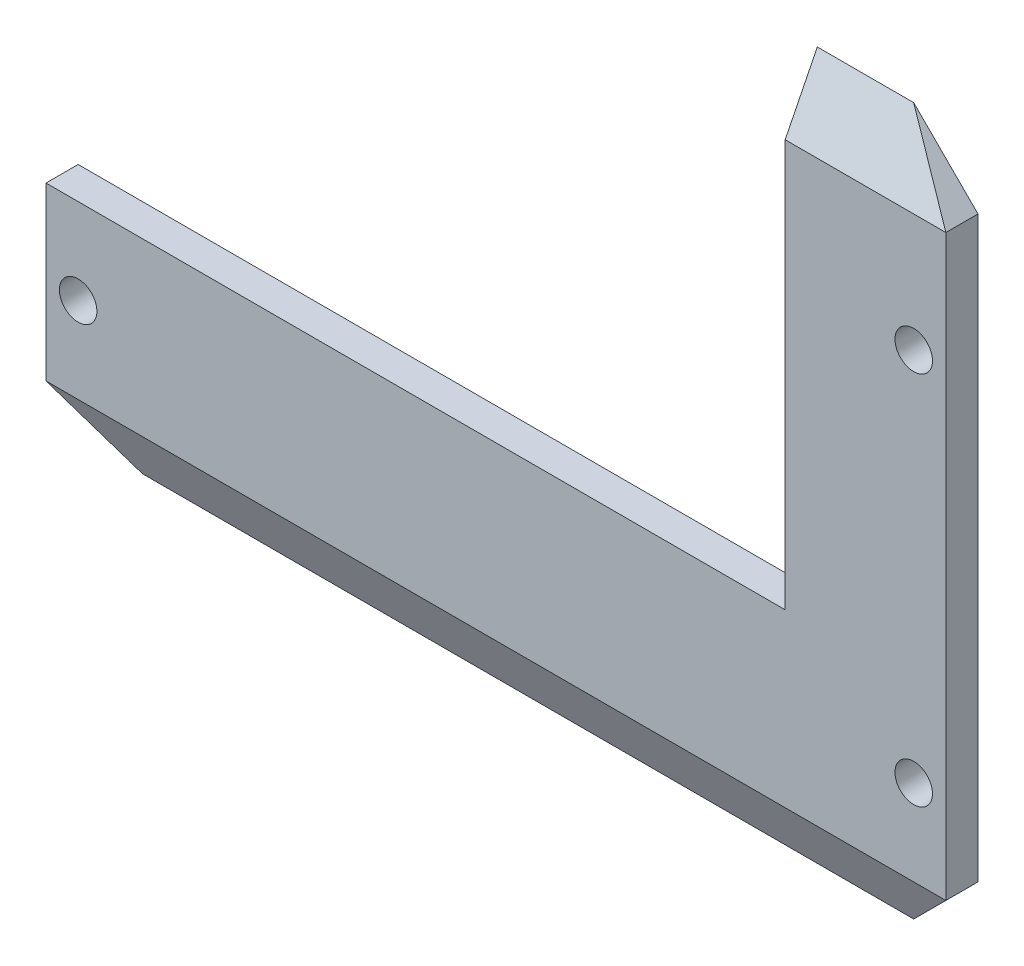
ISO-10303-21;
HEADER;
FILE_DESCRIPTION(('STEP AP214'),'2;1');
FILE_NAME('part.step','',(''),(''),'','','');
FILE_SCHEMA(('AUTOMOTIVE_DESIGN { 1 0 10303 214 1 1 1 1 }'));
ENDSEC;
DATA;
#1=APPLICATION_CONTEXT('core data for automotive mechanical design processes');
#2=APPLICATION_PROTOCOL_DEFINITION('international standard','automotive_design',2000,#1);
#3=PRODUCT_CONTEXT('',#1,'mechanical');
#4=PRODUCT('Part','Part','',(#3));
#5=PRODUCT_RELATED_PRODUCT_CATEGORY('part','',(#4));
#6=PRODUCT_DEFINITION_FORMATION('','',#4);
#7=PRODUCT_DEFINITION_CONTEXT('part definition',#1,'design');
#8=PRODUCT_DEFINITION('design','',#6,#7);
#9=PRODUCT_DEFINITION_SHAPE('','',#8);
#10=(LENGTH_UNIT() NAMED_UNIT(*) SI_UNIT(.MILLI.,.METRE.));
#11=(NAMED_UNIT(*) PLANE_ANGLE_UNIT() SI_UNIT($,.RADIAN.));
#12=(NAMED_UNIT(*) SI_UNIT($,.STERADIAN.) SOLID_ANGLE_UNIT());
#13=UNCERTAINTY_MEASURE_WITH_UNIT(LENGTH_MEASURE(1.E-05),#10,'distance_accuracy_value','');
#14=(GEOMETRIC_REPRESENTATION_CONTEXT(3) GLOBAL_UNCERTAINTY_ASSIGNED_CONTEXT((#13)) GLOBAL_UNIT_ASSIGNED_CONTEXT((#10,
#11,#12)) REPRESENTATION_CONTEXT('',''));
#15=CARTESIAN_POINT('',(0.,0.,0.));
#16=DIRECTION('',(0.,0.,1.));
#17=DIRECTION('',(1.,0.,0.));
#18=AXIS2_PLACEMENT_3D('',#15,#16,#17);
#19=CARTESIAN_POINT('',(42.,-33.,3.));
#20=DIRECTION('',(-1.,0.,0.));
#21=DIRECTION('',(0.,0.,1.));
#22=AXIS2_PLACEMENT_3D('',#19,#20,#21);
#23=PLANE('',#22);
#24=DIRECTION('',(0.,1.,0.));
#25=VECTOR('',#24,1.);
#26=CARTESIAN_POINT('',(42.,-33.,0.));
#27=LINE('',#26,#25);
#28=CARTESIAN_POINT('',(42.,-27.,0.));
#29=VERTEX_POINT('',#28);
#30=CARTESIAN_POINT('',(42.,27.,0.));
#31=VERTEX_POINT('',#30);
#32=EDGE_CURVE('E126',#29,#31,#27,.T.);
#33=ORIENTED_EDGE('',*,*,#32,.T.);
#34=DIRECTION('',(0.,0.,1.));
#35=VECTOR('',#34,1.);
#36=CARTESIAN_POINT('',(42.,27.,3.));
#37=LINE('',#36,#35);
#38=CARTESIAN_POINT('',(42.,27.,3.));
#39=VERTEX_POINT('',#38);
#40=EDGE_CURVE('E147',#31,#39,#37,.T.);
#41=ORIENTED_EDGE('',*,*,#40,.T.);
#42=DIRECTION('',(0.,1.,0.));
#43=VECTOR('',#42,1.);
#44=CARTESIAN_POINT('',(42.,-33.,3.));
#45=LINE('',#44,#43);
#46=CARTESIAN_POINT('',(42.,-27.,3.));
#47=VERTEX_POINT('',#46);
#48=EDGE_CURVE('E117',#47,#39,#45,.T.);
#49=ORIENTED_EDGE('',*,*,#48,.F.);
#50=DIRECTION('',(0.,0.,-1.));
#51=VECTOR('',#50,1.);
#52=CARTESIAN_POINT('',(42.,-27.,3.));
#53=LINE('',#52,#51);
#54=EDGE_CURVE('E144',#47,#29,#53,.T.);
#55=ORIENTED_EDGE('',*,*,#54,.T.);
#56=EDGE_LOOP('',(#33,#41,#49,#55));
#57=FACE_BOUND('',#56,.T.);
#58=ADVANCED_FACE('F32',(#57),#23,.F.);
#59=CARTESIAN_POINT('',(-42.,-33.,3.));
#60=DIRECTION('',(1.,0.,0.));
#61=DIRECTION('',(0.,0.,-1.));
#62=AXIS2_PLACEMENT_3D('',#59,#60,#61);
#63=PLANE('',#62);
#64=DIRECTION('',(0.,-1.,0.));
#65=VECTOR('',#64,1.);
#66=CARTESIAN_POINT('',(-42.,-33.,3.));
#67=LINE('',#66,#65);
#68=CARTESIAN_POINT('',(-42.,-11.,3.));
#69=VERTEX_POINT('',#68);
#70=CARTESIAN_POINT('',(-42.,-27.,3.));
#71=VERTEX_POINT('',#70);
#72=EDGE_CURVE('E109',#69,#71,#67,.T.);
#73=ORIENTED_EDGE('',*,*,#72,.F.);
#74=DIRECTION('',(0.,0.,1.));
#75=VECTOR('',#74,1.);
#76=CARTESIAN_POINT('',(-42.,-11.,-7.));
#77=LINE('',#76,#75);
#78=CARTESIAN_POINT('',(-42.,-11.,0.));
#79=VERTEX_POINT('',#78);
#80=EDGE_CURVE('E94',#79,#69,#77,.T.);
#81=ORIENTED_EDGE('',*,*,#80,.F.);
#82=DIRECTION('',(0.,-1.,0.));
#83=VECTOR('',#82,1.);
#84=CARTESIAN_POINT('',(-42.,-33.,0.));
#85=LINE('',#84,#83);
#86=CARTESIAN_POINT('',(-42.,-27.,0.));
#87=VERTEX_POINT('',#86);
#88=EDGE_CURVE('E133',#79,#87,#85,.T.);
#89=ORIENTED_EDGE('',*,*,#88,.T.);
#90=DIRECTION('',(0.,0.,1.));
#91=VECTOR('',#90,1.);
#92=CARTESIAN_POINT('',(-42.,-27.,3.));
#93=LINE('',#92,#91);
#94=EDGE_CURVE('E115',#87,#71,#93,.T.);
#95=ORIENTED_EDGE('',*,*,#94,.T.);
#96=EDGE_LOOP('',(#73,#81,#89,#95));
#97=FACE_BOUND('',#96,.T.);
#98=ADVANCED_FACE('F113',(#97),#63,.F.);
#99=CARTESIAN_POINT('',(0.,0.,3.));
#100=DIRECTION('',(0.,0.,-1.));
#101=DIRECTION('',(-1.,0.,0.));
#102=AXIS2_PLACEMENT_3D('',#99,#100,#101);
#103=PLANE('',#102);
#104=CARTESIAN_POINT('',(39.,-19.,3.));
#105=DIRECTION('',(0.,0.,1.));
#106=DIRECTION('',(-1.,0.,0.));
#107=AXIS2_PLACEMENT_3D('',#104,#105,#106);
#108=CIRCLE('',#107,1.75);
#109=CARTESIAN_POINT('',(37.25,-19.,3.));
#110=VERTEX_POINT('',#109);
#111=EDGE_CURVE('E304',#110,#110,#108,.T.);
#112=ORIENTED_EDGE('',*,*,#111,.F.);
#113=EDGE_LOOP('',(#112));
#114=FACE_BOUND('',#113,.T.);
#115=CARTESIAN_POINT('',(39.,16.,3.));
#116=DIRECTION('',(0.,0.,1.));
#117=DIRECTION('',(1.,0.,0.));
#118=AXIS2_PLACEMENT_3D('',#115,#116,#117);
#119=CIRCLE('',#118,1.75);
#120=CARTESIAN_POINT('',(40.75,16.,3.));
#121=VERTEX_POINT('',#120);
#122=EDGE_CURVE('E166',#121,#121,#119,.T.);
#123=ORIENTED_EDGE('',*,*,#122,.F.);
#124=EDGE_LOOP('',(#123));
#125=FACE_BOUND('',#124,.T.);
#126=CARTESIAN_POINT('',(-39.,-19.,3.));
#127=DIRECTION('',(0.,0.,1.));
#128=DIRECTION('',(1.,0.,0.));
#129=AXIS2_PLACEMENT_3D('',#126,#127,#128);
#130=CIRCLE('',#129,1.75);
#131=CARTESIAN_POINT('',(-37.25,-19.,3.));
#132=VERTEX_POINT('',#131);
#133=EDGE_CURVE('E307',#132,#132,#130,.T.);
#134=ORIENTED_EDGE('',*,*,#133,.F.);
#135=EDGE_LOOP('',(#134));
#136=FACE_BOUND('',#135,.T.);
#137=DIRECTION('',(-1.,0.,0.));
#138=VECTOR('',#137,1.);
#139=CARTESIAN_POINT('',(0.,26.9999999999999,3.));
#140=LINE('',#139,#138);
#141=CARTESIAN_POINT('',(27.,26.9999999999999,3.));
#142=VERTEX_POINT('',#141);
#143=EDGE_CURVE('E151',#39,#142,#140,.T.);
#144=ORIENTED_EDGE('',*,*,#143,.T.);
#145=DIRECTION('',(0.,1.,0.));
#146=VECTOR('',#145,1.);
#147=CARTESIAN_POINT('',(27.,-11.,3.));
#148=LINE('',#147,#146);
#149=CARTESIAN_POINT('',(27.,-11.,3.));
#150=VERTEX_POINT('',#149);
#151=EDGE_CURVE('E47',#150,#142,#148,.T.);
#152=ORIENTED_EDGE('',*,*,#151,.F.);
#153=DIRECTION('',(1.,0.,0.));
#154=VECTOR('',#153,1.);
#155=CARTESIAN_POINT('',(27.,-11.,3.));
#156=LINE('',#155,#154);
#157=EDGE_CURVE('E98',#69,#150,#156,.T.);
#158=ORIENTED_EDGE('',*,*,#157,.F.);
#159=ORIENTED_EDGE('',*,*,#72,.T.);
#160=DIRECTION('',(1.,0.,0.));
#161=VECTOR('',#160,1.);
#162=CARTESIAN_POINT('',(0.,-27.,3.));
#163=LINE('',#162,#161);
#164=EDGE_CURVE('E149',#71,#47,#163,.T.);
#165=ORIENTED_EDGE('',*,*,#164,.T.);
#166=ORIENTED_EDGE('',*,*,#48,.T.);
#167=EDGE_LOOP('',(#144,#152,#158,#159,#165,#166));
#168=FACE_BOUND('',#167,.T.);
#169=ADVANCED_FACE('F107',(#114,#125,#136,#168),#103,.F.);
#170=CARTESIAN_POINT('',(0.,0.,0.));
#171=DIRECTION('',(0.,0.,-1.));
#172=DIRECTION('',(-1.,0.,0.));
#173=AXIS2_PLACEMENT_3D('',#170,#171,#172);
#174=PLANE('',#173);
#175=DIRECTION('',(0.,-1.,0.));
#176=VECTOR('',#175,1.);
#177=CARTESIAN_POINT('',(27.,0.,0.));
#178=LINE('',#177,#176);
#179=CARTESIAN_POINT('',(27.,33.,0.));
#180=VERTEX_POINT('',#179);
#181=CARTESIAN_POINT('',(27.,-11.,0.));
#182=VERTEX_POINT('',#181);
#183=EDGE_CURVE('E159',#180,#182,#178,.T.);
#184=ORIENTED_EDGE('',*,*,#183,.F.);
#185=DIRECTION('',(-1.,0.,0.));
#186=VECTOR('',#185,1.);
#187=CARTESIAN_POINT('',(-42.,33.,0.));
#188=LINE('',#187,#186);
#189=CARTESIAN_POINT('',(36.,33.,0.));
#190=VERTEX_POINT('',#189);
#191=EDGE_CURVE('E129',#190,#180,#188,.T.);
#192=ORIENTED_EDGE('',*,*,#191,.F.);
#193=DIRECTION('',(-0.707106781186548,0.707106781186548,0.));
#194=VECTOR('',#193,1.);
#195=CARTESIAN_POINT('',(34.5,34.5,0.));
#196=LINE('',#195,#194);
#197=EDGE_CURVE('E142',#190,#31,#196,.F.);
#198=ORIENTED_EDGE('',*,*,#197,.T.);
#199=ORIENTED_EDGE('',*,*,#32,.F.);
#200=DIRECTION('',(0.707106781186548,0.707106781186548,0.));
#201=VECTOR('',#200,1.);
#202=CARTESIAN_POINT('',(34.5,-34.5,0.));
#203=LINE('',#202,#201);
#204=CARTESIAN_POINT('',(36.,-33.,0.));
#205=VERTEX_POINT('',#204);
#206=EDGE_CURVE('E139',#29,#205,#203,.F.);
#207=ORIENTED_EDGE('',*,*,#206,.T.);
#208=DIRECTION('',(1.,0.,0.));
#209=VECTOR('',#208,1.);
#210=CARTESIAN_POINT('',(-42.,-33.,0.));
#211=LINE('',#210,#209);
#212=CARTESIAN_POINT('',(-36.,-33.,0.));
#213=VERTEX_POINT('',#212);
#214=EDGE_CURVE('E122',#213,#205,#211,.T.);
#215=ORIENTED_EDGE('',*,*,#214,.F.);
#216=DIRECTION('',(0.707106781186548,-0.707106781186548,0.));
#217=VECTOR('',#216,1.);
#218=CARTESIAN_POINT('',(-34.5,-34.5,0.));
#219=LINE('',#218,#217);
#220=EDGE_CURVE('E119',#213,#87,#219,.F.);
#221=ORIENTED_EDGE('',*,*,#220,.T.);
#222=ORIENTED_EDGE('',*,*,#88,.F.);
#223=DIRECTION('',(-1.,0.,0.));
#224=VECTOR('',#223,1.);
#225=CARTESIAN_POINT('',(0.,-11.,0.));
#226=LINE('',#225,#224);
#227=EDGE_CURVE('E11',#182,#79,#226,.T.);
#228=ORIENTED_EDGE('',*,*,#227,.F.);
#229=EDGE_LOOP('',(#184,#192,#198,#199,#207,#215,#221,#222,#228));
#230=FACE_BOUND('',#229,.T.);
#231=CARTESIAN_POINT('',(39.,-19.,0.));
#232=DIRECTION('',(0.,0.,1.));
#233=DIRECTION('',(-1.,0.,0.));
#234=AXIS2_PLACEMENT_3D('',#231,#232,#233);
#235=CIRCLE('',#234,1.75);
#236=CARTESIAN_POINT('',(37.25,-19.,0.));
#237=VERTEX_POINT('',#236);
#238=EDGE_CURVE('E301',#237,#237,#235,.T.);
#239=ORIENTED_EDGE('',*,*,#238,.T.);
#240=EDGE_LOOP('',(#239));
#241=FACE_BOUND('',#240,.T.);
#242=CARTESIAN_POINT('',(39.,16.,0.));
#243=DIRECTION('',(0.,0.,1.));
#244=DIRECTION('',(1.,0.,0.));
#245=AXIS2_PLACEMENT_3D('',#242,#243,#244);
#246=CIRCLE('',#245,1.75);
#247=CARTESIAN_POINT('',(40.75,16.,0.));
#248=VERTEX_POINT('',#247);
#249=EDGE_CURVE('E305',#248,#248,#246,.T.);
#250=ORIENTED_EDGE('',*,*,#249,.T.);
#251=EDGE_LOOP('',(#250));
#252=FACE_BOUND('',#251,.T.);
#253=CARTESIAN_POINT('',(-39.,-19.,0.));
#254=DIRECTION('',(0.,0.,1.));
#255=DIRECTION('',(1.,0.,0.));
#256=AXIS2_PLACEMENT_3D('',#253,#254,#255);
#257=CIRCLE('',#256,1.75);
#258=CARTESIAN_POINT('',(-37.25,-19.,0.));
#259=VERTEX_POINT('',#258);
#260=EDGE_CURVE('E130',#259,#259,#257,.T.);
#261=ORIENTED_EDGE('',*,*,#260,.T.);
#262=EDGE_LOOP('',(#261));
#263=FACE_BOUND('',#262,.T.);
#264=ADVANCED_FACE('F164',(#230,#241,#252,#263),#174,.T.);
#265=CARTESIAN_POINT('',(36.,33.,3.));
#266=DIRECTION('',(-0.707106781186547,-0.707106781186547,0.));
#267=DIRECTION('',(0.,0.,-1.));
#268=AXIS2_PLACEMENT_3D('',#265,#266,#267);
#269=PLANE('',#268);
#270=ORIENTED_EDGE('',*,*,#197,.F.);
#271=DIRECTION('',(0.666666666666667,-0.666666666666667,0.333333333333333));
#272=VECTOR('',#271,1.);
#273=CARTESIAN_POINT('',(36.6666666666667,32.3333333333333,0.333333333333317));
#274=LINE('',#273,#272);
#275=EDGE_CURVE('E55',#190,#39,#274,.T.);
#276=ORIENTED_EDGE('',*,*,#275,.T.);
#277=ORIENTED_EDGE('',*,*,#40,.F.);
#278=EDGE_LOOP('',(#270,#276,#277));
#279=FACE_BOUND('',#278,.T.);
#280=ADVANCED_FACE('F186',(#279),#269,.F.);
#281=CARTESIAN_POINT('',(42.,-27.,3.));
#282=DIRECTION('',(-0.707106781186547,0.707106781186547,0.));
#283=DIRECTION('',(0.,0.,-1.));
#284=AXIS2_PLACEMENT_3D('',#281,#282,#283);
#285=PLANE('',#284);
#286=ORIENTED_EDGE('',*,*,#54,.F.);
#287=DIRECTION('',(-0.666666666666667,-0.666666666666667,-0.333333333333333));
#288=VECTOR('',#287,1.);
#289=CARTESIAN_POINT('',(42.,-27.,2.99999999999999));
#290=LINE('',#289,#288);
#291=EDGE_CURVE('E154',#47,#205,#290,.T.);
#292=ORIENTED_EDGE('',*,*,#291,.T.);
#293=ORIENTED_EDGE('',*,*,#206,.F.);
#294=EDGE_LOOP('',(#286,#292,#293));
#295=FACE_BOUND('',#294,.T.);
#296=ADVANCED_FACE('F174',(#295),#285,.F.);
#297=CARTESIAN_POINT('',(-36.,-33.,3.));
#298=DIRECTION('',(0.707106781186547,0.707106781186547,0.));
#299=DIRECTION('',(0.,0.,-1.));
#300=AXIS2_PLACEMENT_3D('',#297,#298,#299);
#301=PLANE('',#300);
#302=ORIENTED_EDGE('',*,*,#220,.F.);
#303=DIRECTION('',(-0.666666666666667,0.666666666666667,0.333333333333333));
#304=VECTOR('',#303,1.);
#305=CARTESIAN_POINT('',(-36.6666666666667,-32.3333333333333,0.33333333333333));
#306=LINE('',#305,#304);
#307=EDGE_CURVE('E156',#213,#71,#306,.T.);
#308=ORIENTED_EDGE('',*,*,#307,.T.);
#309=ORIENTED_EDGE('',*,*,#94,.F.);
#310=EDGE_LOOP('',(#302,#308,#309));
#311=FACE_BOUND('',#310,.T.);
#312=ADVANCED_FACE('F179',(#311),#301,.F.);
#313=CARTESIAN_POINT('',(0.,26.9999999999999,3.));
#314=DIRECTION('',(0.,-0.447213595499957,-0.894427190999916));
#315=DIRECTION('',(-1.,0.,0.));
#316=AXIS2_PLACEMENT_3D('',#313,#314,#315);
#317=PLANE('',#316);
#318=DIRECTION('',(0.,-0.894427190999916,0.447213595499957));
#319=VECTOR('',#318,1.);
#320=CARTESIAN_POINT('',(27.,26.9999999999999,3.));
#321=LINE('',#320,#319);
#322=EDGE_CURVE('E40',#142,#180,#321,.F.);
#323=ORIENTED_EDGE('',*,*,#322,.F.);
#324=ORIENTED_EDGE('',*,*,#143,.F.);
#325=ORIENTED_EDGE('',*,*,#275,.F.);
#326=ORIENTED_EDGE('',*,*,#191,.T.);
#327=EDGE_LOOP('',(#323,#324,#325,#326));
#328=FACE_BOUND('',#327,.T.);
#329=ADVANCED_FACE('F168',(#328),#317,.F.);
#330=CARTESIAN_POINT('',(0.,-27.,3.));
#331=DIRECTION('',(0.,0.447213595499957,-0.894427190999916));
#332=DIRECTION('',(1.,0.,0.));
#333=AXIS2_PLACEMENT_3D('',#330,#331,#332);
#334=PLANE('',#333);
#335=ORIENTED_EDGE('',*,*,#307,.F.);
#336=ORIENTED_EDGE('',*,*,#214,.T.);
#337=ORIENTED_EDGE('',*,*,#291,.F.);
#338=ORIENTED_EDGE('',*,*,#164,.F.);
#339=EDGE_LOOP('',(#335,#336,#337,#338));
#340=FACE_BOUND('',#339,.T.);
#341=ADVANCED_FACE('F34',(#340),#334,.F.);
#342=CARTESIAN_POINT('',(-39.,-19.,0.));
#343=DIRECTION('',(0.,0.,1.));
#344=DIRECTION('',(1.,0.,0.));
#345=AXIS2_PLACEMENT_3D('',#342,#343,#344);
#346=CYLINDRICAL_SURFACE('',#345,1.75);
#347=ORIENTED_EDGE('',*,*,#260,.F.);
#348=EDGE_LOOP('',(#347));
#349=FACE_BOUND('',#348,.T.);
#350=ORIENTED_EDGE('',*,*,#133,.T.);
#351=EDGE_LOOP('',(#350));
#352=FACE_BOUND('',#351,.T.);
#353=ADVANCED_FACE('F206',(#349,#352),#346,.F.);
#354=CARTESIAN_POINT('',(39.,16.,0.));
#355=DIRECTION('',(0.,0.,1.));
#356=DIRECTION('',(1.,0.,0.));
#357=AXIS2_PLACEMENT_3D('',#354,#355,#356);
#358=CYLINDRICAL_SURFACE('',#357,1.75);
#359=ORIENTED_EDGE('',*,*,#249,.F.);
#360=EDGE_LOOP('',(#359));
#361=FACE_BOUND('',#360,.T.);
#362=ORIENTED_EDGE('',*,*,#122,.T.);
#363=EDGE_LOOP('',(#362));
#364=FACE_BOUND('',#363,.T.);
#365=ADVANCED_FACE('F209',(#361,#364),#358,.F.);
#366=CARTESIAN_POINT('',(39.,-19.,0.));
#367=DIRECTION('',(0.,0.,1.));
#368=DIRECTION('',(1.,0.,0.));
#369=AXIS2_PLACEMENT_3D('',#366,#367,#368);
#370=CYLINDRICAL_SURFACE('',#369,1.75);
#371=ORIENTED_EDGE('',*,*,#238,.F.);
#372=EDGE_LOOP('',(#371));
#373=FACE_BOUND('',#372,.T.);
#374=ORIENTED_EDGE('',*,*,#111,.T.);
#375=EDGE_LOOP('',(#374));
#376=FACE_BOUND('',#375,.T.);
#377=ADVANCED_FACE('F213',(#373,#376),#370,.F.);
#378=CARTESIAN_POINT('',(27.,-11.,-7.));
#379=DIRECTION('',(1.,0.,0.));
#380=DIRECTION('',(0.,0.,-1.));
#381=AXIS2_PLACEMENT_3D('',#378,#379,#380);
#382=PLANE('',#381);
#383=ORIENTED_EDGE('',*,*,#183,.T.);
#384=DIRECTION('',(0.,0.,1.));
#385=VECTOR('',#384,1.);
#386=CARTESIAN_POINT('',(27.,-11.,-7.));
#387=LINE('',#386,#385);
#388=EDGE_CURVE('E103',#182,#150,#387,.T.);
#389=ORIENTED_EDGE('',*,*,#388,.T.);
#390=ORIENTED_EDGE('',*,*,#151,.T.);
#391=ORIENTED_EDGE('',*,*,#322,.T.);
#392=EDGE_LOOP('',(#383,#389,#390,#391));
#393=FACE_BOUND('',#392,.T.);
#394=ADVANCED_FACE('F158',(#393),#382,.F.);
#395=CARTESIAN_POINT('',(27.,-11.,-7.));
#396=DIRECTION('',(0.,-1.,0.));
#397=DIRECTION('',(1.,0.,0.));
#398=AXIS2_PLACEMENT_3D('',#395,#396,#397);
#399=PLANE('',#398);
#400=ORIENTED_EDGE('',*,*,#227,.T.);
#401=ORIENTED_EDGE('',*,*,#80,.T.);
#402=ORIENTED_EDGE('',*,*,#157,.T.);
#403=ORIENTED_EDGE('',*,*,#388,.F.);
#404=EDGE_LOOP('',(#400,#401,#402,#403));
#405=FACE_BOUND('',#404,.T.);
#406=ADVANCED_FACE('F96',(#405),#399,.F.);
#407=CLOSED_SHELL('',(#58,#98,#169,#264,#280,#296,#312,#329,#341,#353,#365,#377,#394,#406));
#408=MANIFOLD_SOLID_BREP('B2',#407);
#409=ADVANCED_BREP_SHAPE_REPRESENTATION('',(#18,#408),#14);
#410=SHAPE_DEFINITION_REPRESENTATION(#9,#409);
ENDSEC;
END-ISO-10303-21;
